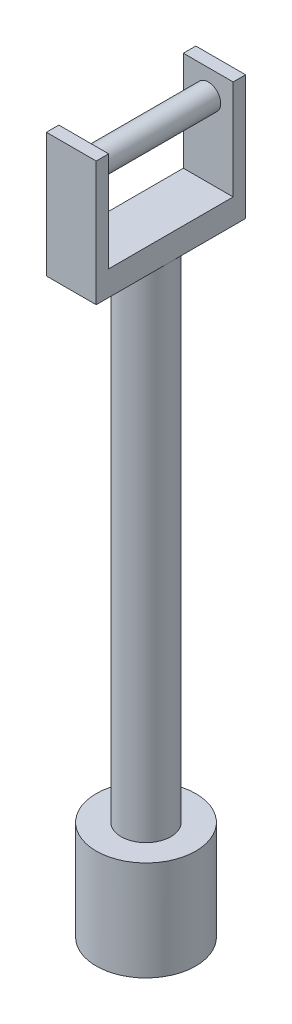
ISO-10303-21;
HEADER;
FILE_DESCRIPTION(('STEP AP214'),'2;1');
FILE_NAME('part.step','',(''),(''),'','','');
FILE_SCHEMA(('AUTOMOTIVE_DESIGN { 1 0 10303 214 1 1 1 1 }'));
ENDSEC;
DATA;
#1=APPLICATION_CONTEXT('core data for automotive mechanical design processes');
#2=APPLICATION_PROTOCOL_DEFINITION('international standard','automotive_design',2000,#1);
#3=PRODUCT_CONTEXT('',#1,'mechanical');
#4=PRODUCT('Part','Part','',(#3));
#5=PRODUCT_RELATED_PRODUCT_CATEGORY('part','',(#4));
#6=PRODUCT_DEFINITION_FORMATION('','',#4);
#7=PRODUCT_DEFINITION_CONTEXT('part definition',#1,'design');
#8=PRODUCT_DEFINITION('design','',#6,#7);
#9=PRODUCT_DEFINITION_SHAPE('','',#8);
#10=(LENGTH_UNIT() NAMED_UNIT(*) SI_UNIT(.MILLI.,.METRE.));
#11=(NAMED_UNIT(*) PLANE_ANGLE_UNIT() SI_UNIT($,.RADIAN.));
#12=(NAMED_UNIT(*) SI_UNIT($,.STERADIAN.) SOLID_ANGLE_UNIT());
#13=UNCERTAINTY_MEASURE_WITH_UNIT(LENGTH_MEASURE(1.E-05),#10,'distance_accuracy_value','');
#14=(GEOMETRIC_REPRESENTATION_CONTEXT(3) GLOBAL_UNCERTAINTY_ASSIGNED_CONTEXT((#13)) GLOBAL_UNIT_ASSIGNED_CONTEXT((#10,
#11,#12)) REPRESENTATION_CONTEXT('',''));
#15=CARTESIAN_POINT('',(0.,0.,0.));
#16=DIRECTION('',(0.,0.,1.));
#17=DIRECTION('',(1.,0.,0.));
#18=AXIS2_PLACEMENT_3D('',#15,#16,#17);
#19=CARTESIAN_POINT('',(0.,292.1,0.));
#20=DIRECTION('',(0.,1.,0.));
#21=DIRECTION('',(0.,0.,1.));
#22=AXIS2_PLACEMENT_3D('',#19,#20,#21);
#23=PLANE('',#22);
#24=DIRECTION('',(0.,0.,1.));
#25=VECTOR('',#24,1.);
#26=CARTESIAN_POINT('',(-12.7,292.1,-38.1));
#27=LINE('',#26,#25);
#28=CARTESIAN_POINT('',(-12.7,292.1,-31.75));
#29=VERTEX_POINT('',#28);
#30=CARTESIAN_POINT('',(-12.7,292.1,31.75));
#31=VERTEX_POINT('',#30);
#32=EDGE_CURVE('E175',#29,#31,#27,.T.);
#33=ORIENTED_EDGE('',*,*,#32,.T.);
#34=DIRECTION('',(-1.,0.,0.));
#35=VECTOR('',#34,1.);
#36=CARTESIAN_POINT('',(-12.7,292.1,31.75));
#37=LINE('',#36,#35);
#38=CARTESIAN_POINT('',(12.7,292.1,31.75));
#39=VERTEX_POINT('',#38);
#40=EDGE_CURVE('E142',#39,#31,#37,.T.);
#41=ORIENTED_EDGE('',*,*,#40,.F.);
#42=DIRECTION('',(0.,0.,-1.));
#43=VECTOR('',#42,1.);
#44=CARTESIAN_POINT('',(12.7,292.1,-38.1));
#45=LINE('',#44,#43);
#46=CARTESIAN_POINT('',(12.7,292.1,-31.75));
#47=VERTEX_POINT('',#46);
#48=EDGE_CURVE('E173',#39,#47,#45,.T.);
#49=ORIENTED_EDGE('',*,*,#48,.T.);
#50=DIRECTION('',(1.,0.,0.));
#51=VECTOR('',#50,1.);
#52=CARTESIAN_POINT('',(-12.7,292.1,-31.75));
#53=LINE('',#52,#51);
#54=EDGE_CURVE('E67',#29,#47,#53,.T.);
#55=ORIENTED_EDGE('',*,*,#54,.F.);
#56=EDGE_LOOP('',(#33,#41,#49,#55));
#57=FACE_BOUND('',#56,.T.);
#58=ADVANCED_FACE('F42',(#57),#23,.T.);
#59=CARTESIAN_POINT('',(0.,25.4,0.));
#60=DIRECTION('',(0.,-1.,0.));
#61=DIRECTION('',(0.,0.,-1.));
#62=AXIS2_PLACEMENT_3D('',#59,#60,#61);
#63=CYLINDRICAL_SURFACE('',#62,25.4);
#64=CARTESIAN_POINT('',(0.,25.4,0.));
#65=DIRECTION('',(0.,1.,0.));
#66=DIRECTION('',(0.,0.,1.));
#67=AXIS2_PLACEMENT_3D('',#64,#65,#66);
#68=CIRCLE('',#67,25.4);
#69=CARTESIAN_POINT('',(0.,25.4,25.4));
#70=VERTEX_POINT('',#69);
#71=EDGE_CURVE('E51',#70,#70,#68,.T.);
#72=ORIENTED_EDGE('',*,*,#71,.F.);
#73=EDGE_LOOP('',(#72));
#74=FACE_BOUND('',#73,.T.);
#75=CARTESIAN_POINT('',(0.,-25.4,0.));
#76=DIRECTION('',(0.,-1.,0.));
#77=DIRECTION('',(0.,0.,-1.));
#78=AXIS2_PLACEMENT_3D('',#75,#76,#77);
#79=CIRCLE('',#78,25.4);
#80=CARTESIAN_POINT('',(0.,-25.4,-25.4));
#81=VERTEX_POINT('',#80);
#82=EDGE_CURVE('E204',#81,#81,#79,.T.);
#83=ORIENTED_EDGE('',*,*,#82,.F.);
#84=EDGE_LOOP('',(#83));
#85=FACE_BOUND('',#84,.T.);
#86=ADVANCED_FACE('F44',(#74,#85),#63,.T.);
#87=CARTESIAN_POINT('',(0.,25.4,0.));
#88=DIRECTION('',(0.,1.,0.));
#89=DIRECTION('',(0.,0.,1.));
#90=AXIS2_PLACEMENT_3D('',#87,#88,#89);
#91=PLANE('',#90);
#92=CARTESIAN_POINT('',(0.,25.4,0.));
#93=DIRECTION('',(0.,1.,0.));
#94=DIRECTION('',(0.,0.,1.));
#95=AXIS2_PLACEMENT_3D('',#92,#93,#94);
#96=CIRCLE('',#95,12.7);
#97=CARTESIAN_POINT('',(0.,25.4,12.7));
#98=VERTEX_POINT('',#97);
#99=EDGE_CURVE('E11',#98,#98,#96,.T.);
#100=ORIENTED_EDGE('',*,*,#99,.F.);
#101=EDGE_LOOP('',(#100));
#102=FACE_BOUND('',#101,.T.);
#103=ORIENTED_EDGE('',*,*,#71,.T.);
#104=EDGE_LOOP('',(#103));
#105=FACE_BOUND('',#104,.T.);
#106=ADVANCED_FACE('F198',(#102,#105),#91,.T.);
#107=CARTESIAN_POINT('',(0.,279.4,0.));
#108=DIRECTION('',(0.,-1.,0.));
#109=DIRECTION('',(0.,0.,-1.));
#110=AXIS2_PLACEMENT_3D('',#107,#108,#109);
#111=CYLINDRICAL_SURFACE('',#110,12.7);
#112=CARTESIAN_POINT('',(0.,279.4,0.));
#113=DIRECTION('',(0.,1.,0.));
#114=DIRECTION('',(0.,0.,1.));
#115=AXIS2_PLACEMENT_3D('',#112,#113,#114);
#116=CIRCLE('',#115,12.7);
#117=CARTESIAN_POINT('',(12.7,279.4,0.));
#118=VERTEX_POINT('',#117);
#119=CARTESIAN_POINT('',(-12.7,279.4,0.));
#120=VERTEX_POINT('',#119);
#121=EDGE_CURVE('E193',#118,#120,#116,.T.);
#122=ORIENTED_EDGE('',*,*,#121,.F.);
#123=EDGE_CURVE('E192',#120,#118,#116,.T.);
#124=ORIENTED_EDGE('',*,*,#123,.F.);
#125=EDGE_LOOP('',(#122,#124));
#126=FACE_BOUND('',#125,.T.);
#127=ORIENTED_EDGE('',*,*,#99,.T.);
#128=EDGE_LOOP('',(#127));
#129=FACE_BOUND('',#128,.T.);
#130=ADVANCED_FACE('F236',(#126,#129),#111,.T.);
#131=CARTESIAN_POINT('',(0.,279.4,0.));
#132=DIRECTION('',(0.,1.,0.));
#133=DIRECTION('',(0.,0.,1.));
#134=AXIS2_PLACEMENT_3D('',#131,#132,#133);
#135=PLANE('',#134);
#136=DIRECTION('',(0.,0.,-1.));
#137=VECTOR('',#136,1.);
#138=CARTESIAN_POINT('',(12.7,279.4,-38.1));
#139=LINE('',#138,#137);
#140=CARTESIAN_POINT('',(12.7,279.4,-38.1));
#141=VERTEX_POINT('',#140);
#142=EDGE_CURVE('E172',#118,#141,#139,.T.);
#143=ORIENTED_EDGE('',*,*,#142,.F.);
#144=ORIENTED_EDGE('',*,*,#121,.T.);
#145=DIRECTION('',(0.,0.,1.));
#146=VECTOR('',#145,1.);
#147=CARTESIAN_POINT('',(-12.7,279.4,-38.1));
#148=LINE('',#147,#146);
#149=CARTESIAN_POINT('',(-12.7,279.4,-38.1));
#150=VERTEX_POINT('',#149);
#151=EDGE_CURVE('E183',#150,#120,#148,.T.);
#152=ORIENTED_EDGE('',*,*,#151,.F.);
#153=DIRECTION('',(-1.,0.,0.));
#154=VECTOR('',#153,1.);
#155=CARTESIAN_POINT('',(-12.7,279.4,-38.1));
#156=LINE('',#155,#154);
#157=EDGE_CURVE('E181',#141,#150,#156,.T.);
#158=ORIENTED_EDGE('',*,*,#157,.F.);
#159=EDGE_LOOP('',(#143,#144,#152,#158));
#160=FACE_BOUND('',#159,.T.);
#161=ADVANCED_FACE('F232',(#160),#135,.F.);
#162=CARTESIAN_POINT('',(-12.7,279.4,38.1));
#163=VERTEX_POINT('',#162);
#164=EDGE_CURVE('E125',#120,#163,#148,.T.);
#165=ORIENTED_EDGE('',*,*,#164,.F.);
#166=ORIENTED_EDGE('',*,*,#123,.T.);
#167=CARTESIAN_POINT('',(12.7,279.4,38.1));
#168=VERTEX_POINT('',#167);
#169=EDGE_CURVE('E178',#168,#118,#139,.T.);
#170=ORIENTED_EDGE('',*,*,#169,.F.);
#171=DIRECTION('',(1.,0.,0.));
#172=VECTOR('',#171,1.);
#173=CARTESIAN_POINT('',(-12.7,279.4,38.1));
#174=LINE('',#173,#172);
#175=EDGE_CURVE('E176',#163,#168,#174,.T.);
#176=ORIENTED_EDGE('',*,*,#175,.F.);
#177=EDGE_LOOP('',(#165,#166,#170,#176));
#178=FACE_BOUND('',#177,.T.);
#179=ADVANCED_FACE('F235',(#178),#135,.F.);
#180=CARTESIAN_POINT('',(12.7,292.1,-38.1));
#181=DIRECTION('',(-1.,0.,0.));
#182=DIRECTION('',(0.,0.,1.));
#183=AXIS2_PLACEMENT_3D('',#180,#181,#182);
#184=PLANE('',#183);
#185=ORIENTED_EDGE('',*,*,#169,.T.);
#186=ORIENTED_EDGE('',*,*,#142,.T.);
#187=DIRECTION('',(0.,-1.,0.));
#188=VECTOR('',#187,1.);
#189=CARTESIAN_POINT('',(12.7,292.1,-38.1));
#190=LINE('',#189,#188);
#191=CARTESIAN_POINT('',(12.7,342.9,-38.1));
#192=VERTEX_POINT('',#191);
#193=EDGE_CURVE('E189',#192,#141,#190,.T.);
#194=ORIENTED_EDGE('',*,*,#193,.F.);
#195=DIRECTION('',(0.,0.,-1.));
#196=VECTOR('',#195,1.);
#197=CARTESIAN_POINT('',(12.7,342.9,-38.1));
#198=LINE('',#197,#196);
#199=CARTESIAN_POINT('',(12.7,342.9,-31.75));
#200=VERTEX_POINT('',#199);
#201=EDGE_CURVE('E159',#200,#192,#198,.T.);
#202=ORIENTED_EDGE('',*,*,#201,.F.);
#203=DIRECTION('',(0.,-1.,0.));
#204=VECTOR('',#203,1.);
#205=CARTESIAN_POINT('',(12.7,342.9,-31.75));
#206=LINE('',#205,#204);
#207=EDGE_CURVE('E165',#200,#47,#206,.T.);
#208=ORIENTED_EDGE('',*,*,#207,.T.);
#209=ORIENTED_EDGE('',*,*,#48,.F.);
#210=DIRECTION('',(0.,-1.,0.));
#211=VECTOR('',#210,1.);
#212=CARTESIAN_POINT('',(12.7,342.9,31.75));
#213=LINE('',#212,#211);
#214=CARTESIAN_POINT('',(12.7,342.9,31.75));
#215=VERTEX_POINT('',#214);
#216=EDGE_CURVE('E59',#215,#39,#213,.T.);
#217=ORIENTED_EDGE('',*,*,#216,.F.);
#218=DIRECTION('',(0.,0.,-1.));
#219=VECTOR('',#218,1.);
#220=CARTESIAN_POINT('',(12.7,342.9,38.1));
#221=LINE('',#220,#219);
#222=CARTESIAN_POINT('',(12.7,342.9,38.1));
#223=VERTEX_POINT('',#222);
#224=EDGE_CURVE('E137',#223,#215,#221,.T.);
#225=ORIENTED_EDGE('',*,*,#224,.F.);
#226=DIRECTION('',(0.,-1.,0.));
#227=VECTOR('',#226,1.);
#228=CARTESIAN_POINT('',(12.7,292.1,38.1));
#229=LINE('',#228,#227);
#230=EDGE_CURVE('E129',#223,#168,#229,.T.);
#231=ORIENTED_EDGE('',*,*,#230,.T.);
#232=EDGE_LOOP('',(#185,#186,#194,#202,#208,#209,#217,#225,#231));
#233=FACE_BOUND('',#232,.T.);
#234=ADVANCED_FACE('F245',(#233),#184,.F.);
#235=CARTESIAN_POINT('',(-12.7,292.1,-38.1));
#236=DIRECTION('',(0.,0.,1.));
#237=DIRECTION('',(1.,0.,0.));
#238=AXIS2_PLACEMENT_3D('',#235,#236,#237);
#239=PLANE('',#238);
#240=ORIENTED_EDGE('',*,*,#157,.T.);
#241=DIRECTION('',(0.,-1.,0.));
#242=VECTOR('',#241,1.);
#243=CARTESIAN_POINT('',(-12.7,292.1,-38.1));
#244=LINE('',#243,#242);
#245=CARTESIAN_POINT('',(-12.7,342.9,-38.1));
#246=VERTEX_POINT('',#245);
#247=EDGE_CURVE('E128',#246,#150,#244,.T.);
#248=ORIENTED_EDGE('',*,*,#247,.F.);
#249=DIRECTION('',(-1.,0.,0.));
#250=VECTOR('',#249,1.);
#251=CARTESIAN_POINT('',(-12.7,342.9,-38.1));
#252=LINE('',#251,#250);
#253=EDGE_CURVE('E162',#192,#246,#252,.T.);
#254=ORIENTED_EDGE('',*,*,#253,.F.);
#255=ORIENTED_EDGE('',*,*,#193,.T.);
#256=EDGE_LOOP('',(#240,#248,#254,#255));
#257=FACE_BOUND('',#256,.T.);
#258=ADVANCED_FACE('F242',(#257),#239,.F.);
#259=CARTESIAN_POINT('',(-12.7,292.1,-38.1));
#260=DIRECTION('',(1.,0.,0.));
#261=DIRECTION('',(0.,0.,-1.));
#262=AXIS2_PLACEMENT_3D('',#259,#260,#261);
#263=PLANE('',#262);
#264=ORIENTED_EDGE('',*,*,#151,.T.);
#265=ORIENTED_EDGE('',*,*,#164,.T.);
#266=DIRECTION('',(0.,-1.,0.));
#267=VECTOR('',#266,1.);
#268=CARTESIAN_POINT('',(-12.7,292.1,38.1));
#269=LINE('',#268,#267);
#270=CARTESIAN_POINT('',(-12.7,342.9,38.1));
#271=VERTEX_POINT('',#270);
#272=EDGE_CURVE('E117',#271,#163,#269,.T.);
#273=ORIENTED_EDGE('',*,*,#272,.F.);
#274=DIRECTION('',(0.,0.,1.));
#275=VECTOR('',#274,1.);
#276=CARTESIAN_POINT('',(-12.7,342.9,38.1));
#277=LINE('',#276,#275);
#278=CARTESIAN_POINT('',(-12.7,342.9,31.75));
#279=VERTEX_POINT('',#278);
#280=EDGE_CURVE('E123',#279,#271,#277,.T.);
#281=ORIENTED_EDGE('',*,*,#280,.F.);
#282=DIRECTION('',(0.,-1.,0.));
#283=VECTOR('',#282,1.);
#284=CARTESIAN_POINT('',(-12.7,342.9,31.75));
#285=LINE('',#284,#283);
#286=EDGE_CURVE('E150',#279,#31,#285,.T.);
#287=ORIENTED_EDGE('',*,*,#286,.T.);
#288=ORIENTED_EDGE('',*,*,#32,.F.);
#289=DIRECTION('',(0.,-1.,0.));
#290=VECTOR('',#289,1.);
#291=CARTESIAN_POINT('',(-12.7,342.9,-31.75));
#292=LINE('',#291,#290);
#293=CARTESIAN_POINT('',(-12.7,342.9,-31.75));
#294=VERTEX_POINT('',#293);
#295=EDGE_CURVE('E169',#294,#29,#292,.T.);
#296=ORIENTED_EDGE('',*,*,#295,.F.);
#297=DIRECTION('',(0.,0.,1.));
#298=VECTOR('',#297,1.);
#299=CARTESIAN_POINT('',(-12.7,342.9,-38.1));
#300=LINE('',#299,#298);
#301=EDGE_CURVE('E154',#246,#294,#300,.T.);
#302=ORIENTED_EDGE('',*,*,#301,.F.);
#303=ORIENTED_EDGE('',*,*,#247,.T.);
#304=EDGE_LOOP('',(#264,#265,#273,#281,#287,#288,#296,#302,#303));
#305=FACE_BOUND('',#304,.T.);
#306=ADVANCED_FACE('F120',(#305),#263,.F.);
#307=CARTESIAN_POINT('',(-12.7,292.1,38.1));
#308=DIRECTION('',(0.,0.,-1.));
#309=DIRECTION('',(-1.,0.,0.));
#310=AXIS2_PLACEMENT_3D('',#307,#308,#309);
#311=PLANE('',#310);
#312=ORIENTED_EDGE('',*,*,#175,.T.);
#313=ORIENTED_EDGE('',*,*,#230,.F.);
#314=DIRECTION('',(1.,0.,0.));
#315=VECTOR('',#314,1.);
#316=CARTESIAN_POINT('',(-12.7,342.9,38.1));
#317=LINE('',#316,#315);
#318=EDGE_CURVE('E132',#271,#223,#317,.T.);
#319=ORIENTED_EDGE('',*,*,#318,.F.);
#320=ORIENTED_EDGE('',*,*,#272,.T.);
#321=EDGE_LOOP('',(#312,#313,#319,#320));
#322=FACE_BOUND('',#321,.T.);
#323=ADVANCED_FACE('F133',(#322),#311,.F.);
#324=CARTESIAN_POINT('',(-12.7,342.9,-31.75));
#325=DIRECTION('',(0.,0.,-1.));
#326=DIRECTION('',(-1.,0.,0.));
#327=AXIS2_PLACEMENT_3D('',#324,#325,#326);
#328=PLANE('',#327);
#329=CARTESIAN_POINT('',(0.,330.2,-31.75));
#330=DIRECTION('',(0.,0.,-1.));
#331=DIRECTION('',(-1.,0.,0.));
#332=AXIS2_PLACEMENT_3D('',#329,#330,#331);
#333=CIRCLE('',#332,6.35);
#334=CARTESIAN_POINT('',(-6.34999999999999,330.2,-31.75));
#335=VERTEX_POINT('',#334);
#336=EDGE_CURVE('E146',#335,#335,#333,.F.);
#337=ORIENTED_EDGE('',*,*,#336,.F.);
#338=EDGE_LOOP('',(#337));
#339=FACE_BOUND('',#338,.T.);
#340=ORIENTED_EDGE('',*,*,#54,.T.);
#341=ORIENTED_EDGE('',*,*,#207,.F.);
#342=DIRECTION('',(1.,0.,0.));
#343=VECTOR('',#342,1.);
#344=CARTESIAN_POINT('',(-12.7,342.9,-31.75));
#345=LINE('',#344,#343);
#346=EDGE_CURVE('E157',#294,#200,#345,.T.);
#347=ORIENTED_EDGE('',*,*,#346,.F.);
#348=ORIENTED_EDGE('',*,*,#295,.T.);
#349=EDGE_LOOP('',(#340,#341,#347,#348));
#350=FACE_BOUND('',#349,.T.);
#351=ADVANCED_FACE('F230',(#339,#350),#328,.F.);
#352=CARTESIAN_POINT('',(0.,342.9,0.));
#353=DIRECTION('',(0.,1.,0.));
#354=DIRECTION('',(0.,0.,1.));
#355=AXIS2_PLACEMENT_3D('',#352,#353,#354);
#356=PLANE('',#355);
#357=ORIENTED_EDGE('',*,*,#301,.T.);
#358=ORIENTED_EDGE('',*,*,#346,.T.);
#359=ORIENTED_EDGE('',*,*,#201,.T.);
#360=ORIENTED_EDGE('',*,*,#253,.T.);
#361=EDGE_LOOP('',(#357,#358,#359,#360));
#362=FACE_BOUND('',#361,.T.);
#363=ADVANCED_FACE('F298',(#362),#356,.T.);
#364=CARTESIAN_POINT('',(-12.7,342.9,31.75));
#365=DIRECTION('',(0.,0.,1.));
#366=DIRECTION('',(1.,0.,0.));
#367=AXIS2_PLACEMENT_3D('',#364,#365,#366);
#368=PLANE('',#367);
#369=CARTESIAN_POINT('',(0.,330.2,31.75));
#370=DIRECTION('',(0.,0.,1.));
#371=DIRECTION('',(1.,0.,0.));
#372=AXIS2_PLACEMENT_3D('',#369,#370,#371);
#373=CIRCLE('',#372,6.35);
#374=CARTESIAN_POINT('',(6.35,330.2,31.75));
#375=VERTEX_POINT('',#374);
#376=EDGE_CURVE('E46',#375,#375,#373,.T.);
#377=ORIENTED_EDGE('',*,*,#376,.T.);
#378=EDGE_LOOP('',(#377));
#379=FACE_BOUND('',#378,.T.);
#380=ORIENTED_EDGE('',*,*,#40,.T.);
#381=ORIENTED_EDGE('',*,*,#286,.F.);
#382=DIRECTION('',(-1.,0.,0.));
#383=VECTOR('',#382,1.);
#384=CARTESIAN_POINT('',(-12.7,342.9,31.75));
#385=LINE('',#384,#383);
#386=EDGE_CURVE('E140',#215,#279,#385,.T.);
#387=ORIENTED_EDGE('',*,*,#386,.F.);
#388=ORIENTED_EDGE('',*,*,#216,.T.);
#389=EDGE_LOOP('',(#380,#381,#387,#388));
#390=FACE_BOUND('',#389,.T.);
#391=ADVANCED_FACE('F212',(#379,#390),#368,.F.);
#392=CARTESIAN_POINT('',(0.,342.9,0.));
#393=DIRECTION('',(0.,-1.,0.));
#394=DIRECTION('',(0.,0.,-1.));
#395=AXIS2_PLACEMENT_3D('',#392,#393,#394);
#396=PLANE('',#395);
#397=ORIENTED_EDGE('',*,*,#280,.T.);
#398=ORIENTED_EDGE('',*,*,#318,.T.);
#399=ORIENTED_EDGE('',*,*,#224,.T.);
#400=ORIENTED_EDGE('',*,*,#386,.T.);
#401=EDGE_LOOP('',(#397,#398,#399,#400));
#402=FACE_BOUND('',#401,.T.);
#403=ADVANCED_FACE('F139',(#402),#396,.F.);
#404=CARTESIAN_POINT('',(0.,330.2,-49.7105122421383));
#405=DIRECTION('',(0.,0.,1.));
#406=DIRECTION('',(1.,0.,0.));
#407=AXIS2_PLACEMENT_3D('',#404,#405,#406);
#408=CYLINDRICAL_SURFACE('',#407,6.35);
#409=ORIENTED_EDGE('',*,*,#336,.T.);
#410=EDGE_LOOP('',(#409));
#411=FACE_BOUND('',#410,.T.);
#412=ORIENTED_EDGE('',*,*,#376,.F.);
#413=EDGE_LOOP('',(#412));
#414=FACE_BOUND('',#413,.T.);
#415=ADVANCED_FACE('F214',(#411,#414),#408,.T.);
#416=CARTESIAN_POINT('',(0.,-25.4,0.));
#417=DIRECTION('',(0.,-1.,0.));
#418=DIRECTION('',(0.,0.,-1.));
#419=AXIS2_PLACEMENT_3D('',#416,#417,#418);
#420=PLANE('',#419);
#421=ORIENTED_EDGE('',*,*,#82,.T.);
#422=EDGE_LOOP('',(#421));
#423=FACE_BOUND('',#422,.T.);
#424=ADVANCED_FACE('F216',(#423),#420,.T.);
#425=CLOSED_SHELL('',(#58,#86,#106,#130,#161,#179,#234,#258,#306,#323,#351,#363,#391,#403,#415,#424));
#426=MANIFOLD_SOLID_BREP('B2',#425);
#427=ADVANCED_BREP_SHAPE_REPRESENTATION('',(#18,#426),#14);
#428=SHAPE_DEFINITION_REPRESENTATION(#9,#427);
ENDSEC;
END-ISO-10303-21;
